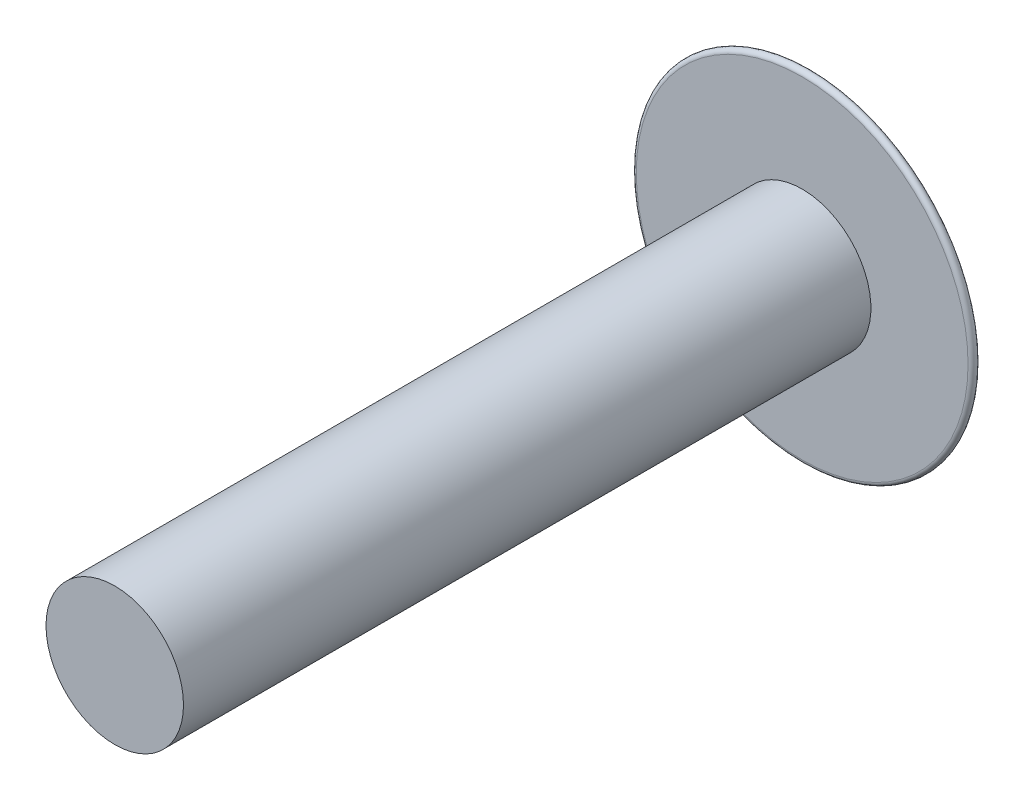
ISO-10303-21;
HEADER;
FILE_DESCRIPTION(('STEP AP214'),'2;1');
FILE_NAME('part.step','',(''),(''),'','','');
FILE_SCHEMA(('AUTOMOTIVE_DESIGN { 1 0 10303 214 1 1 1 1 }'));
ENDSEC;
DATA;
#1=APPLICATION_CONTEXT('core data for automotive mechanical design processes');
#2=APPLICATION_PROTOCOL_DEFINITION('international standard','automotive_design',2000,#1);
#3=PRODUCT_CONTEXT('',#1,'mechanical');
#4=PRODUCT('Part','Part','',(#3));
#5=PRODUCT_RELATED_PRODUCT_CATEGORY('part','',(#4));
#6=PRODUCT_DEFINITION_FORMATION('','',#4);
#7=PRODUCT_DEFINITION_CONTEXT('part definition',#1,'design');
#8=PRODUCT_DEFINITION('design','',#6,#7);
#9=PRODUCT_DEFINITION_SHAPE('','',#8);
#10=(LENGTH_UNIT() NAMED_UNIT(*) SI_UNIT(.MILLI.,.METRE.));
#11=(NAMED_UNIT(*) PLANE_ANGLE_UNIT() SI_UNIT($,.RADIAN.));
#12=(NAMED_UNIT(*) SI_UNIT($,.STERADIAN.) SOLID_ANGLE_UNIT());
#13=UNCERTAINTY_MEASURE_WITH_UNIT(LENGTH_MEASURE(1.E-05),#10,'distance_accuracy_value','');
#14=(GEOMETRIC_REPRESENTATION_CONTEXT(3) GLOBAL_UNCERTAINTY_ASSIGNED_CONTEXT((#13)) GLOBAL_UNIT_ASSIGNED_CONTEXT((#10,
#11,#12)) REPRESENTATION_CONTEXT('',''));
#15=CARTESIAN_POINT('',(0.,0.,0.));
#16=DIRECTION('',(0.,0.,1.));
#17=DIRECTION('',(1.,0.,0.));
#18=AXIS2_PLACEMENT_3D('',#15,#16,#17);
#19=CARTESIAN_POINT('',(-1.23667245925998,0.15,-0.20234762702739));
#20=DIRECTION('',(0.,1.,0.));
#21=DIRECTION('',(0.,0.,1.));
#22=AXIS2_PLACEMENT_3D('',#19,#20,#21);
#23=PLANE('',#22);
#24=CARTESIAN_POINT('',(1.9807318336479,0.15,2.25315737734632));
#25=CARTESIAN_POINT('',(2.00176052863639,0.15,2.19274277840471));
#26=CARTESIAN_POINT('',(2.01986448353778,0.15,2.13131427534168));
#27=CARTESIAN_POINT('',(2.05009869942067,0.15,2.00700083175286));
#28=CARTESIAN_POINT('',(2.0622286573749,0.15,1.94411581751581));
#29=CARTESIAN_POINT('',(2.08036874677344,0.15,1.81760477824223));
#30=CARTESIAN_POINT('',(2.08639213915598,0.15,1.75398066367697));
#31=CARTESIAN_POINT('',(2.09231778646416,0.15,1.62647545697694));
#32=CARTESIAN_POINT('',(2.09222105396279,0.15,1.56259440910054));
#33=CARTESIAN_POINT('',(2.08349415656828,0.15,1.38683733286197));
#34=CARTESIAN_POINT('',(2.0684637938988,0.15,1.27521181991642));
#35=CARTESIAN_POINT('',(2.01988606921188,0.15,1.05616586028869));
#36=CARTESIAN_POINT('',(1.98634597470009,0.15,0.948743780921732));
#37=CARTESIAN_POINT('',(1.90170344156024,0.15,0.741021943417742));
#38=CARTESIAN_POINT('',(1.85059813866008,0.15,0.640723350093115));
#39=CARTESIAN_POINT('',(1.73227201083875,0.15,0.450124398920791));
#40=CARTESIAN_POINT('',(1.66504994826993,0.15,0.359824809701372));
#41=CARTESIAN_POINT('',(1.51641828405849,0.15,0.191803912532076));
#42=CARTESIAN_POINT('',(1.43501126325792,0.15,0.114080321430438));
#43=CARTESIAN_POINT('',(1.26026013550992,0.15,-0.0266450153703614));
#44=CARTESIAN_POINT('',(1.16690966977637,0.15,-0.0896388679508981));
#45=CARTESIAN_POINT('',(0.970845529519257,0.15,-0.199158906846654));
#46=CARTESIAN_POINT('',(0.868118504639797,0.15,-0.245661137585591));
#47=CARTESIAN_POINT('',(0.656514659883268,0.15,-0.320694033740084));
#48=CARTESIAN_POINT('',(0.54765369526948,0.15,-0.34926890792244));
#49=CARTESIAN_POINT('',(0.40135063975603,0.15,-0.375001614744874));
#50=CARTESIAN_POINT('',(0.36520716651879,0.15,-0.380355348466281));
#51=CARTESIAN_POINT('',(0.29269734093965,0.15,-0.389162338362739));
#52=CARTESIAN_POINT('',(0.256331090951353,0.15,-0.392616409503886));
#53=CARTESIAN_POINT('',(0.183381573452436,0.15,-0.39772595687816));
#54=CARTESIAN_POINT('',(0.146797986027513,0.15,-0.399376627431283));
#55=CARTESIAN_POINT('',(0.0735725978190277,0.15,-0.401334388252726));
#56=CARTESIAN_POINT('',(0.0369307739791031,0.15,-0.401640337570668));
#57=CARTESIAN_POINT('',(-0.0354391833108917,0.15,-0.40164354281463));
#58=CARTESIAN_POINT('',(-0.0711673032677424,0.15,-0.401355795472978));
#59=CARTESIAN_POINT('',(-0.142589334944957,0.15,-0.399526499084391));
#60=CARTESIAN_POINT('',(-0.178283251882254,0.15,-0.397985188705217));
#61=CARTESIAN_POINT('',(-0.285129474164688,0.15,-0.390773596735302));
#62=CARTESIAN_POINT('',(-0.356135042538909,0.15,-0.382518255971762));
#63=CARTESIAN_POINT('',(-0.496622955456623,0.15,-0.358617479645475));
#64=CARTESIAN_POINT('',(-0.566109906946423,0.15,-0.342999077155867));
#65=CARTESIAN_POINT('',(-0.703109101215335,0.15,-0.304471704720529));
#66=CARTESIAN_POINT('',(-0.770619389482818,0.15,-0.281555768299838));
#67=CARTESIAN_POINT('',(-0.895778443010773,0.15,-0.231475146541525));
#68=CARTESIAN_POINT('',(-0.953712316235864,0.15,-0.205021708853274));
#69=CARTESIAN_POINT('',(-1.06675303988389,0.15,-0.14674321046169));
#70=CARTESIAN_POINT('',(-1.12186121330222,0.15,-0.114920694069969));
#71=CARTESIAN_POINT('',(-1.28252995332373,0.15,-0.0115694567467164));
#72=CARTESIAN_POINT('',(-1.38323461914015,0.15,0.0677626841474094));
#73=CARTESIAN_POINT('',(-1.55666966231021,0.15,0.233620543955632));
#74=CARTESIAN_POINT('',(-1.63129956105455,0.15,0.318188051982523));
#75=CARTESIAN_POINT('',(-1.76519705433422,0.15,0.498555460449505));
#76=CARTESIAN_POINT('',(-1.82448805619697,0.15,0.594337918361575));
#77=CARTESIAN_POINT('',(-1.92609252211714,0.15,0.794418978900494));
#78=CARTESIAN_POINT('',(-1.96841868750523,0.15,0.898711139757412));
#79=CARTESIAN_POINT('',(-2.03498688973399,0.15,1.11300069375803));
#80=CARTESIAN_POINT('',(-2.05921654008508,0.15,1.22300193961094));
#81=CARTESIAN_POINT('',(-2.08886107386277,0.15,1.44551032590493));
#82=CARTESIAN_POINT('',(-2.09427299059567,0.15,1.55801785865896));
#83=CARTESIAN_POINT('',(-2.08610082937087,0.15,1.78225445698857));
#84=CARTESIAN_POINT('',(-2.07254327539894,0.15,1.89398439044222));
#85=CARTESIAN_POINT('',(-2.04095633077018,0.15,2.04597925632334));
#86=CARTESIAN_POINT('',(-2.03078602751148,0.15,2.08799500069739));
#87=CARTESIAN_POINT('',(-2.00775991011883,0.15,2.17120562623259));
#88=CARTESIAN_POINT('',(-1.99490878711651,0.15,2.21240180540121));
#89=CARTESIAN_POINT('',(-1.98073183364791,0.15,2.25315737734632));
#90=B_SPLINE_CURVE_WITH_KNOTS('',3,(#24,#25,#26,#27,#28,#29,#30,#31,#32,#33,#34,#35,#36,#37,#38,
#39,#40,#41,#42,#43,#44,#45,#46,#47,#48,#49,#50,#51,#52,#53,#54,#55,#56,#57,#58,#59,#60,#61,#62,
#63,#64,#65,#66,#67,#68,#69,#70,#71,#72,#73,#74,#75,#76,#77,#78,#79,#80,#81,#82,#83,#84,#85,#86,
#87,#88,#89),.UNSPECIFIED.,.F.,.F.,(4,2,2,2,2,2,2,2,2,2,2,2,2,2,2,2,2,2,2,2,2,2,2,2,2,2,2,2,2,2,
2,2,4),(0.,0.191828959597776,0.383667648597912,0.575088845044785,0.766478370989555,
1.10265442548165,1.43869858044221,1.77479755848749,2.11092235471427,2.44698605940167,
2.78322943752168,3.11995925815094,3.45585540679562,3.56543777862352,3.67497310224407,
3.78479960764026,3.89471927913668,4.0018964017771,4.10905312357872,4.3231011000502,
4.53636925959417,4.74984162562359,4.94060637216062,5.1312809712609,5.51326668708469,
5.85010814570088,6.18643250737553,6.52250459533974,6.8588065036894,7.1951614290255,
7.53104651715674,7.66066260299712,7.79005374988866),.UNSPECIFIED.);
#91=CARTESIAN_POINT('',(-0.15,0.15,-0.399023887971907));
#92=VERTEX_POINT('',#91);
#93=CARTESIAN_POINT('',(-0.956971478553369,0.15,-0.20234762702739));
#94=VERTEX_POINT('',#93);
#95=EDGE_CURVE('E239',#92,#94,#90,.T.);
#96=ORIENTED_EDGE('',*,*,#95,.F.);
#97=DIRECTION('',(0.,0.,1.));
#98=VECTOR('',#97,1.);
#99=CARTESIAN_POINT('',(-0.15,0.15,-0.20234762702739));
#100=LINE('',#99,#98);
#101=CARTESIAN_POINT('',(-0.15,0.15,-0.20234762702739));
#102=VERTEX_POINT('',#101);
#103=EDGE_CURVE('E185',#92,#102,#100,.T.);
#104=ORIENTED_EDGE('',*,*,#103,.T.);
#105=DIRECTION('',(1.,0.,0.));
#106=VECTOR('',#105,1.);
#107=CARTESIAN_POINT('',(-1.23667245925998,0.15,-0.20234762702739));
#108=LINE('',#107,#106);
#109=EDGE_CURVE('E189',#94,#102,#108,.T.);
#110=ORIENTED_EDGE('',*,*,#109,.F.);
#111=EDGE_LOOP('',(#96,#104,#110));
#112=FACE_BOUND('',#111,.T.);
#113=ADVANCED_FACE('F34',(#112),#23,.F.);
#114=CARTESIAN_POINT('',(-1.23667245925998,-0.15,-0.20234762702739));
#115=DIRECTION('',(0.,-1.,0.));
#116=DIRECTION('',(0.,0.,-1.));
#117=AXIS2_PLACEMENT_3D('',#114,#115,#116);
#118=PLANE('',#117);
#119=DIRECTION('',(1.,0.,0.));
#120=VECTOR('',#119,1.);
#121=CARTESIAN_POINT('',(-1.23667245925998,-0.15,-0.20234762702739));
#122=LINE('',#121,#120);
#123=CARTESIAN_POINT('',(-0.956971478554223,-0.15,-0.20234762702739));
#124=VERTEX_POINT('',#123);
#125=CARTESIAN_POINT('',(-0.15,-0.15,-0.20234762702739));
#126=VERTEX_POINT('',#125);
#127=EDGE_CURVE('E194',#124,#126,#122,.T.);
#128=ORIENTED_EDGE('',*,*,#127,.T.);
#129=DIRECTION('',(0.,0.,-1.));
#130=VECTOR('',#129,1.);
#131=CARTESIAN_POINT('',(-0.15,-0.15,-0.20234762702739));
#132=LINE('',#131,#130);
#133=CARTESIAN_POINT('',(-0.15,-0.15,-0.399023887971445));
#134=VERTEX_POINT('',#133);
#135=EDGE_CURVE('E128',#126,#134,#132,.T.);
#136=ORIENTED_EDGE('',*,*,#135,.T.);
#137=CARTESIAN_POINT('',(-1.9807318336479,-0.15,2.25315737734632));
#138=CARTESIAN_POINT('',(-2.00176052863639,-0.15,2.19274277840471));
#139=CARTESIAN_POINT('',(-2.01986448353778,-0.15,2.13131427534168));
#140=CARTESIAN_POINT('',(-2.05009869942067,-0.15,2.00700083175286));
#141=CARTESIAN_POINT('',(-2.0622286573749,-0.15,1.94411581751581));
#142=CARTESIAN_POINT('',(-2.08036874677344,-0.15,1.81760477824222));
#143=CARTESIAN_POINT('',(-2.08639213915598,-0.15,1.75398066367697));
#144=CARTESIAN_POINT('',(-2.09231778646416,-0.15,1.62647545697694));
#145=CARTESIAN_POINT('',(-2.09222105396279,-0.15,1.56259440910054));
#146=CARTESIAN_POINT('',(-2.08349415656828,-0.15,1.38683733286197));
#147=CARTESIAN_POINT('',(-2.0684637938988,-0.15,1.27521181991642));
#148=CARTESIAN_POINT('',(-2.01988606921188,-0.15,1.05616586028869));
#149=CARTESIAN_POINT('',(-1.98634597470009,-0.15,0.948743780921732));
#150=CARTESIAN_POINT('',(-1.90170344156024,-0.15,0.741021943417742));
#151=CARTESIAN_POINT('',(-1.85059813866008,-0.15,0.640723350093114));
#152=CARTESIAN_POINT('',(-1.73227201083875,-0.15,0.450124398920791));
#153=CARTESIAN_POINT('',(-1.66504994826993,-0.15,0.359824809701372));
#154=CARTESIAN_POINT('',(-1.51641828405849,-0.15,0.191803912532076));
#155=CARTESIAN_POINT('',(-1.43501126325791,-0.15,0.114080321430438));
#156=CARTESIAN_POINT('',(-1.26026013550992,-0.15,-0.0266450153703614));
#157=CARTESIAN_POINT('',(-1.16690966977637,-0.15,-0.0896388679508985));
#158=CARTESIAN_POINT('',(-0.970845529519257,-0.15,-0.199158906846654));
#159=CARTESIAN_POINT('',(-0.868118504639797,-0.15,-0.24566113758559));
#160=CARTESIAN_POINT('',(-0.656514659883267,-0.15,-0.320694033740084));
#161=CARTESIAN_POINT('',(-0.54765369526948,-0.15,-0.34926890792244));
#162=CARTESIAN_POINT('',(-0.401350639756029,-0.15,-0.375001614744874));
#163=CARTESIAN_POINT('',(-0.36520716651879,-0.15,-0.380355348466281));
#164=CARTESIAN_POINT('',(-0.29269734093965,-0.15,-0.389162338362739));
#165=CARTESIAN_POINT('',(-0.256331090951353,-0.15,-0.392616409503886));
#166=CARTESIAN_POINT('',(-0.183381573452436,-0.15,-0.39772595687816));
#167=CARTESIAN_POINT('',(-0.146797986027513,-0.15,-0.399376627431282));
#168=CARTESIAN_POINT('',(-0.0735725978190278,-0.15,-0.401334388252726));
#169=CARTESIAN_POINT('',(-0.0369307739791032,-0.15,-0.401640337570667));
#170=CARTESIAN_POINT('',(0.0354391833108915,-0.15,-0.40164354281463));
#171=CARTESIAN_POINT('',(0.0711673032677419,-0.15,-0.401355795472978));
#172=CARTESIAN_POINT('',(0.142589334944956,-0.15,-0.399526499084391));
#173=CARTESIAN_POINT('',(0.178283251882253,-0.15,-0.397985188705217));
#174=CARTESIAN_POINT('',(0.285129474164687,-0.15,-0.390773596735302));
#175=CARTESIAN_POINT('',(0.356135042538909,-0.15,-0.382518255971762));
#176=CARTESIAN_POINT('',(0.496622955456623,-0.15,-0.358617479645475));
#177=CARTESIAN_POINT('',(0.566109906946423,-0.15,-0.342999077155867));
#178=CARTESIAN_POINT('',(0.703109101215335,-0.15,-0.304471704720529));
#179=CARTESIAN_POINT('',(0.770619389482818,-0.15,-0.281555768299838));
#180=CARTESIAN_POINT('',(0.895778443010773,-0.15,-0.231475146541525));
#181=CARTESIAN_POINT('',(0.953712316235864,-0.15,-0.205021708853274));
#182=CARTESIAN_POINT('',(1.06675303988389,-0.15,-0.14674321046169));
#183=CARTESIAN_POINT('',(1.12186121330222,-0.15,-0.11492069406997));
#184=CARTESIAN_POINT('',(1.28252995332373,-0.15,-0.0115694567467163));
#185=CARTESIAN_POINT('',(1.38323461914015,-0.15,0.0677626841474094));
#186=CARTESIAN_POINT('',(1.55666966231021,-0.15,0.233620543955631));
#187=CARTESIAN_POINT('',(1.63129956105455,-0.15,0.318188051982523));
#188=CARTESIAN_POINT('',(1.76519705433422,-0.15,0.498555460449505));
#189=CARTESIAN_POINT('',(1.82448805619697,-0.15,0.594337918361575));
#190=CARTESIAN_POINT('',(1.92609252211714,-0.15,0.794418978900494));
#191=CARTESIAN_POINT('',(1.96841868750523,-0.15,0.898711139757412));
#192=CARTESIAN_POINT('',(2.03498688973399,-0.15,1.11300069375803));
#193=CARTESIAN_POINT('',(2.05921654008508,-0.15,1.22300193961094));
#194=CARTESIAN_POINT('',(2.08886107386277,-0.15,1.44551032590493));
#195=CARTESIAN_POINT('',(2.09427299059567,-0.15,1.55801785865896));
#196=CARTESIAN_POINT('',(2.08610082937087,-0.15,1.78225445698857));
#197=CARTESIAN_POINT('',(2.07254327539894,-0.15,1.89398439044222));
#198=CARTESIAN_POINT('',(2.04095633077018,-0.15,2.04597925632334));
#199=CARTESIAN_POINT('',(2.03078602751148,-0.15,2.08799500069739));
#200=CARTESIAN_POINT('',(2.00775991011883,-0.15,2.17120562623259));
#201=CARTESIAN_POINT('',(1.99490878711651,-0.15,2.21240180540121));
#202=CARTESIAN_POINT('',(1.98073183364791,-0.15,2.25315737734632));
#203=B_SPLINE_CURVE_WITH_KNOTS('',3,(#137,#138,#139,#140,#141,#142,#143,#144,#145,#146,#147,
#148,#149,#150,#151,#152,#153,#154,#155,#156,#157,#158,#159,#160,#161,#162,#163,#164,#165,#166,
#167,#168,#169,#170,#171,#172,#173,#174,#175,#176,#177,#178,#179,#180,#181,#182,#183,#184,#185,
#186,#187,#188,#189,#190,#191,#192,#193,#194,#195,#196,#197,#198,#199,#200,#201,#202),
.UNSPECIFIED.,.F.,.F.,(4,2,2,2,2,2,2,2,2,2,2,2,2,2,2,2,2,2,2,2,2,2,2,2,2,2,2,2,2,2,2,2,4),(0.,
0.191828959597776,0.383667648597912,0.575088845044786,0.766478370989555,1.10265442548165,
1.43869858044221,1.77479755848749,2.11092235471427,2.44698605940167,2.78322943752168,
3.11995925815094,3.45585540679562,3.56543777862352,3.67497310224407,3.78479960764027,
3.89471927913668,4.0018964017771,4.10905312357872,4.3231011000502,4.53636925959417,
4.74984162562359,4.94060637216062,5.13128097126091,5.51326668708469,5.85010814570088,
6.18643250737553,6.52250459533974,6.85880650368941,7.1951614290255,7.53104651715675,
7.66066260299712,7.79005374988866),.UNSPECIFIED.);
#204=EDGE_CURVE('E209',#124,#134,#203,.T.);
#205=ORIENTED_EDGE('',*,*,#204,.F.);
#206=EDGE_LOOP('',(#128,#136,#205));
#207=FACE_BOUND('',#206,.T.);
#208=ADVANCED_FACE('F222',(#207),#118,.F.);
#209=CARTESIAN_POINT('',(0.,0.,5.));
#210=DIRECTION('',(0.,0.,-1.));
#211=DIRECTION('',(-1.,0.,0.));
#212=AXIS2_PLACEMENT_3D('',#209,#210,#211);
#213=CYLINDRICAL_SURFACE('',#212,0.5);
#214=CARTESIAN_POINT('',(0.,0.,5.));
#215=DIRECTION('',(0.,0.,1.));
#216=DIRECTION('',(1.,0.,0.));
#217=AXIS2_PLACEMENT_3D('',#214,#215,#216);
#218=CIRCLE('',#217,0.5);
#219=CARTESIAN_POINT('',(0.5,0.,5.));
#220=VERTEX_POINT('',#219);
#221=EDGE_CURVE('E199',#220,#220,#218,.T.);
#222=ORIENTED_EDGE('',*,*,#221,.F.);
#223=EDGE_LOOP('',(#222));
#224=FACE_BOUND('',#223,.T.);
#225=CARTESIAN_POINT('',(0.,0.,0.));
#226=DIRECTION('',(0.,0.,-1.));
#227=DIRECTION('',(-1.,0.,0.));
#228=AXIS2_PLACEMENT_3D('',#225,#226,#227);
#229=CIRCLE('',#228,0.5);
#230=CARTESIAN_POINT('',(-0.5,0.,0.));
#231=VERTEX_POINT('',#230);
#232=EDGE_CURVE('E192',#231,#231,#229,.T.);
#233=ORIENTED_EDGE('',*,*,#232,.F.);
#234=EDGE_LOOP('',(#233));
#235=FACE_BOUND('',#234,.T.);
#236=ADVANCED_FACE('F235',(#224,#235),#213,.T.);
#237=CARTESIAN_POINT('',(0.,0.,5.));
#238=DIRECTION('',(0.,0.,1.));
#239=DIRECTION('',(1.,0.,0.));
#240=AXIS2_PLACEMENT_3D('',#237,#238,#239);
#241=PLANE('',#240);
#242=ORIENTED_EDGE('',*,*,#221,.T.);
#243=EDGE_LOOP('',(#242));
#244=FACE_BOUND('',#243,.T.);
#245=ADVANCED_FACE('F367',(#244),#241,.T.);
#246=CARTESIAN_POINT('',(0.,0.,0.));
#247=DIRECTION('',(0.,0.,-1.));
#248=DIRECTION('',(-1.,0.,0.));
#249=AXIS2_PLACEMENT_3D('',#246,#247,#248);
#250=PLANE('',#249);
#251=CARTESIAN_POINT('',(0.,0.,0.));
#252=DIRECTION('',(0.,0.,-1.));
#253=DIRECTION('',(-1.,0.,0.));
#254=AXIS2_PLACEMENT_3D('',#251,#252,#253);
#255=CIRCLE('',#254,1.20667245925998);
#256=CARTESIAN_POINT('',(-1.20667245925998,0.,0.));
#257=VERTEX_POINT('',#256);
#258=EDGE_CURVE('E202',#257,#257,#255,.F.);
#259=ORIENTED_EDGE('',*,*,#258,.T.);
#260=EDGE_LOOP('',(#259));
#261=FACE_BOUND('',#260,.T.);
#262=ORIENTED_EDGE('',*,*,#232,.T.);
#263=EDGE_LOOP('',(#262));
#264=FACE_BOUND('',#263,.T.);
#265=ADVANCED_FACE('F352',(#261,#264),#250,.F.);
#266=CARTESIAN_POINT('',(0.,0.,1.59765237297261));
#267=DIRECTION('',(0.,0.,1.));
#268=DIRECTION('',(1.,0.,0.));
#269=AXIS2_PLACEMENT_3D('',#266,#267,#268);
#270=DEGENERATE_TOROIDAL_SURFACE('',#269,0.0968761929315048,2.,.T.);
#271=ORIENTED_EDGE('',*,*,#204,.T.);
#272=CARTESIAN_POINT('',(-0.15,1.51986574185648,0.19978563484473));
#273=CARTESIAN_POINT('',(-0.15,1.48033668470579,0.15952395746752));
#274=CARTESIAN_POINT('',(-0.15,1.43909212960415,0.120948006772945));
#275=CARTESIAN_POINT('',(-0.15,1.35349448063534,0.0474297410459339));
#276=CARTESIAN_POINT('',(-0.15,1.30914191146457,0.0124868151465816));
#277=CARTESIAN_POINT('',(-0.15,1.21811272289814,-0.0531739248528913));
#278=CARTESIAN_POINT('',(-0.15,1.17146505190894,-0.083931880331723));
#279=CARTESIAN_POINT('',(-0.15,1.07575587641082,-0.141434705018059));
#280=CARTESIAN_POINT('',(-0.15,1.02669426373527,-0.168179394176725));
#281=CARTESIAN_POINT('',(-0.15,0.926351679231923,-0.21754401180451));
#282=CARTESIAN_POINT('',(-0.15,0.875064401506339,-0.240151126037802));
#283=CARTESIAN_POINT('',(-0.15,0.770780731459415,-0.280985311831887));
#284=CARTESIAN_POINT('',(-0.15,0.717784440459191,-0.29921264251446));
#285=CARTESIAN_POINT('',(-0.15,0.610195402548457,-0.331249951732982));
#286=CARTESIAN_POINT('',(-0.15,0.55559633503521,-0.345038816396749));
#287=CARTESIAN_POINT('',(-0.15,0.47299645237588,-0.362274156216351));
#288=CARTESIAN_POINT('',(-0.15,0.445344365579856,-0.367444845307821));
#289=CARTESIAN_POINT('',(-0.15,0.389853396650167,-0.376640356102589));
#290=CARTESIAN_POINT('',(-0.15,0.362014542073925,-0.380665343205923));
#291=CARTESIAN_POINT('',(-0.15,0.296277307751538,-0.388817489766143));
#292=CARTESIAN_POINT('',(-0.15,0.258319699408649,-0.392472675081974));
#293=CARTESIAN_POINT('',(-0.15,0.182258020655554,-0.397808919462967));
#294=CARTESIAN_POINT('',(-0.15,0.144153901481863,-0.39948925145767));
#295=CARTESIAN_POINT('',(-0.15,0.0678673804423485,-0.401436821536904));
#296=CARTESIAN_POINT('',(-0.15,0.0296849430488854,-0.401702109685675));
#297=CARTESIAN_POINT('',(-0.15,-0.0466771127029377,-0.40156902130527));
#298=CARTESIAN_POINT('',(-0.15,-0.0848567310581688,-0.401170694499269));
#299=CARTESIAN_POINT('',(-0.15,-0.161132202474818,-0.398807361282795));
#300=CARTESIAN_POINT('',(-0.15,-0.199228101014246,-0.39684424732105));
#301=CARTESIAN_POINT('',(-0.15,-0.275260350536199,-0.390922096896443));
#302=CARTESIAN_POINT('',(-0.15,-0.313196731656613,-0.3869634562697));
#303=CARTESIAN_POINT('',(-0.15,-0.388716619114492,-0.376970884334261));
#304=CARTESIAN_POINT('',(-0.15,-0.426300694321727,-0.370941276238484));
#305=CARTESIAN_POINT('',(-0.15,-0.501073522510429,-0.356780177944843));
#306=CARTESIAN_POINT('',(-0.15,-0.538262229285071,-0.348648444822294));
#307=CARTESIAN_POINT('',(-0.15,-0.629807355276779,-0.325894812866979));
#308=CARTESIAN_POINT('',(-0.15,-0.683860077795966,-0.310029484936004));
#309=CARTESIAN_POINT('',(-0.15,-0.79048130356366,-0.273792564433528));
#310=CARTESIAN_POINT('',(-0.15,-0.843048464138101,-0.25341703365801));
#311=CARTESIAN_POINT('',(-0.15,-0.946181413624328,-0.208343979923589));
#312=CARTESIAN_POINT('',(-0.15,-0.996750761954164,-0.1836546119866));
#313=CARTESIAN_POINT('',(-0.15,-1.09559617956995,-0.130118919908181));
#314=CARTESIAN_POINT('',(-0.15,-1.14387357493174,-0.10127503943366));
#315=CARTESIAN_POINT('',(-0.15,-1.25027372597619,-0.0314429970767258));
#316=CARTESIAN_POINT('',(-0.15,-1.30761834529418,0.0107384607006712));
#317=CARTESIAN_POINT('',(-0.15,-1.41751214145363,0.100979977604977));
#318=CARTESIAN_POINT('',(-0.15,-1.47005961173548,0.149042114631672));
#319=CARTESIAN_POINT('',(-0.15,-1.51986574185648,0.19978563484473));
#320=B_SPLINE_CURVE_WITH_KNOTS('',3,(#272,#273,#274,#275,#276,#277,#278,#279,#280,#281,#282,
#283,#284,#285,#286,#287,#288,#289,#290,#291,#292,#293,#294,#295,#296,#297,#298,#299,#300,#301,
#302,#303,#304,#305,#306,#307,#308,#309,#310,#311,#312,#313,#314,#315,#316,#317,#318,#319),
.UNSPECIFIED.,.F.,.F.,(4,2,2,2,2,2,2,2,2,2,2,2,2,2,2,2,2,2,2,2,2,2,2,4),(0.,0.169216916307519,
0.338405333839646,0.505835176305444,0.673272528001665,0.841219974879212,1.00915748300937,
1.17788245555895,1.26225646661547,1.34661829077637,1.46095904900337,1.57534189024,
1.68988231082029,1.8044141495305,1.91880768356973,2.03317853523361,2.14731207064282,
2.26145880139321,2.43024727039228,2.59918370704388,2.76780416936099,2.93632585181641,
3.14947232404043,3.36269432886658),.UNSPECIFIED.);
#321=CARTESIAN_POINT('',(-0.15,-0.5,-0.356639498270072));
#322=VERTEX_POINT('',#321);
#323=EDGE_CURVE('E179',#134,#322,#320,.T.);
#324=ORIENTED_EDGE('',*,*,#323,.T.);
#325=CARTESIAN_POINT('',(0.510364164119245,-0.5,-0.30460267294466));
#326=CARTESIAN_POINT('',(0.449506269920126,-0.5,-0.318740711516346));
#327=CARTESIAN_POINT('',(0.388038191917324,-0.5,-0.330087719428435));
#328=CARTESIAN_POINT('',(0.264343153213808,-0.5,-0.347530677416534));
#329=CARTESIAN_POINT('',(0.202116041275197,-0.5,-0.35362556308136));
#330=CARTESIAN_POINT('',(0.0784905447349196,-0.5,-0.36082568910361));
#331=CARTESIAN_POINT('',(0.0170969263019517,-0.5,-0.362017126134148));
#332=CARTESIAN_POINT('',(-0.105588757727667,-0.5,-0.359775046659279));
#333=CARTESIAN_POINT('',(-0.16688085405579,-0.5,-0.356343374073195));
#334=CARTESIAN_POINT('',(-0.275274907445925,-0.5,-0.3458920147218));
#335=CARTESIAN_POINT('',(-0.322471678380412,-0.5,-0.339851461670415));
#336=CARTESIAN_POINT('',(-0.416690276801879,-0.5,-0.324632993616024));
#337=CARTESIAN_POINT('',(-0.463708629680572,-0.5,-0.31543364289191));
#338=CARTESIAN_POINT('',(-0.510364164119245,-0.5,-0.30460267294466));
#339=B_SPLINE_CURVE_WITH_KNOTS('',3,(#325,#326,#327,#328,#329,#330,#331,#332,#333,#334,#335,
#336,#337,#338),.UNSPECIFIED.,.F.,.F.,(4,2,2,2,2,2,4),(0.,0.187316825948604,0.374671605176916,
0.558718468801135,0.74269194737879,0.885339443097491,1.02897473386303),.UNSPECIFIED.);
#340=CARTESIAN_POINT('',(0.15,-0.5,-0.356639498270007));
#341=VERTEX_POINT('',#340);
#342=EDGE_CURVE('E11',#341,#322,#339,.T.);
#343=ORIENTED_EDGE('',*,*,#342,.F.);
#344=CARTESIAN_POINT('',(0.15,-1.51986574185648,0.19978563484473));
#345=CARTESIAN_POINT('',(0.15,-1.48033668470579,0.15952395746752));
#346=CARTESIAN_POINT('',(0.15,-1.43909212960415,0.120948006772945));
#347=CARTESIAN_POINT('',(0.15,-1.35349448063534,0.0474297410459339));
#348=CARTESIAN_POINT('',(0.15,-1.30914191146457,0.0124868151465816));
#349=CARTESIAN_POINT('',(0.15,-1.21811272289814,-0.0531739248528912));
#350=CARTESIAN_POINT('',(0.15,-1.17146505190894,-0.083931880331723));
#351=CARTESIAN_POINT('',(0.15,-1.07575587641082,-0.141434705018059));
#352=CARTESIAN_POINT('',(0.15,-1.02669426373527,-0.168179394176725));
#353=CARTESIAN_POINT('',(0.15,-0.926351679231923,-0.21754401180451));
#354=CARTESIAN_POINT('',(0.15,-0.875064401506339,-0.240151126037802));
#355=CARTESIAN_POINT('',(0.15,-0.770780731459415,-0.280985311831887));
#356=CARTESIAN_POINT('',(0.15,-0.717784440459191,-0.29921264251446));
#357=CARTESIAN_POINT('',(0.15,-0.610195402548457,-0.331249951732982));
#358=CARTESIAN_POINT('',(0.15,-0.55559633503521,-0.345038816396749));
#359=CARTESIAN_POINT('',(0.15,-0.47299645237588,-0.362274156216351));
#360=CARTESIAN_POINT('',(0.15,-0.445344365579856,-0.367444845307821));
#361=CARTESIAN_POINT('',(0.15,-0.389853396650167,-0.376640356102589));
#362=CARTESIAN_POINT('',(0.15,-0.362014542073924,-0.380665343205923));
#363=CARTESIAN_POINT('',(0.15,-0.296277307751538,-0.388817489766144));
#364=CARTESIAN_POINT('',(0.15,-0.258319699408649,-0.392472675081974));
#365=CARTESIAN_POINT('',(0.15,-0.182258020655554,-0.397808919462967));
#366=CARTESIAN_POINT('',(0.15,-0.144153901481863,-0.39948925145767));
#367=CARTESIAN_POINT('',(0.15,-0.0678673804423484,-0.401436821536904));
#368=CARTESIAN_POINT('',(0.15,-0.0296849430488853,-0.401702109685676));
#369=CARTESIAN_POINT('',(0.15,0.0466771127029378,-0.40156902130527));
#370=CARTESIAN_POINT('',(0.15,0.0848567310581689,-0.401170694499269));
#371=CARTESIAN_POINT('',(0.15,0.161132202474818,-0.398807361282795));
#372=CARTESIAN_POINT('',(0.15,0.199228101014246,-0.396844247321051));
#373=CARTESIAN_POINT('',(0.15,0.275260350536199,-0.390922096896444));
#374=CARTESIAN_POINT('',(0.15,0.313196731656613,-0.3869634562697));
#375=CARTESIAN_POINT('',(0.15,0.388716619114493,-0.376970884334261));
#376=CARTESIAN_POINT('',(0.15,0.426300694321728,-0.370941276238484));
#377=CARTESIAN_POINT('',(0.15,0.501073522510429,-0.356780177944843));
#378=CARTESIAN_POINT('',(0.15,0.538262229285071,-0.348648444822294));
#379=CARTESIAN_POINT('',(0.15,0.629807355276779,-0.325894812866979));
#380=CARTESIAN_POINT('',(0.15,0.683860077795967,-0.310029484936004));
#381=CARTESIAN_POINT('',(0.15,0.79048130356366,-0.273792564433529));
#382=CARTESIAN_POINT('',(0.15,0.843048464138102,-0.25341703365801));
#383=CARTESIAN_POINT('',(0.15,0.946181413624329,-0.208343979923589));
#384=CARTESIAN_POINT('',(0.15,0.996750761954165,-0.1836546119866));
#385=CARTESIAN_POINT('',(0.15,1.09559617956996,-0.13011891990818));
#386=CARTESIAN_POINT('',(0.15,1.14387357493174,-0.10127503943366));
#387=CARTESIAN_POINT('',(0.15,1.25027372597619,-0.0314429970767255));
#388=CARTESIAN_POINT('',(0.15,1.30761834529418,0.0107384607006714));
#389=CARTESIAN_POINT('',(0.15,1.41751214145363,0.100979977604978));
#390=CARTESIAN_POINT('',(0.15,1.47005961173549,0.149042114631672));
#391=CARTESIAN_POINT('',(0.15,1.51986574185648,0.19978563484473));
#392=B_SPLINE_CURVE_WITH_KNOTS('',3,(#344,#345,#346,#347,#348,#349,#350,#351,#352,#353,#354,
#355,#356,#357,#358,#359,#360,#361,#362,#363,#364,#365,#366,#367,#368,#369,#370,#371,#372,#373,
#374,#375,#376,#377,#378,#379,#380,#381,#382,#383,#384,#385,#386,#387,#388,#389,#390,#391),
.UNSPECIFIED.,.F.,.F.,(4,2,2,2,2,2,2,2,2,2,2,2,2,2,2,2,2,2,2,2,2,2,2,4),(0.,0.169216916307519,
0.338405333839647,0.505835176305444,0.673272528001665,0.841219974879212,1.00915748300937,
1.17788245555895,1.26225646661547,1.34661829077637,1.46095904900337,1.57534189024,
1.68988231082029,1.8044141495305,1.91880768356973,2.03317853523362,2.14731207064282,
2.26145880139321,2.43024727039228,2.59918370704388,2.76780416936099,2.93632585181641,
3.14947232404044,3.36269432886658),.UNSPECIFIED.);
#393=CARTESIAN_POINT('',(0.15,-0.15,-0.399023887971907));
#394=VERTEX_POINT('',#393);
#395=EDGE_CURVE('E146',#341,#394,#392,.T.);
#396=ORIENTED_EDGE('',*,*,#395,.T.);
#397=CARTESIAN_POINT('',(0.956971478553368,-0.15,-0.202347627027799));
#398=VERTEX_POINT('',#397);
#399=EDGE_CURVE('E208',#394,#398,#203,.T.);
#400=ORIENTED_EDGE('',*,*,#399,.T.);
#401=CARTESIAN_POINT('',(0.,0.,-0.20234762702739));
#402=DIRECTION('',(0.,0.,1.));
#403=DIRECTION('',(1.,0.,0.));
#404=AXIS2_PLACEMENT_3D('',#401,#402,#403);
#405=CIRCLE('',#404,0.96865598163964);
#406=CARTESIAN_POINT('',(0.956971478554223,0.15,-0.20234762702739));
#407=VERTEX_POINT('',#406);
#408=EDGE_CURVE('E216',#398,#407,#405,.T.);
#409=ORIENTED_EDGE('',*,*,#408,.T.);
#410=CARTESIAN_POINT('',(0.15,0.15,-0.399023887971445));
#411=VERTEX_POINT('',#410);
#412=EDGE_CURVE('E244',#407,#411,#90,.T.);
#413=ORIENTED_EDGE('',*,*,#412,.T.);
#414=CARTESIAN_POINT('',(0.15,0.5,-0.356639498270008));
#415=VERTEX_POINT('',#414);
#416=EDGE_CURVE('E156',#411,#415,#392,.T.);
#417=ORIENTED_EDGE('',*,*,#416,.T.);
#418=CARTESIAN_POINT('',(0.510364164119245,0.5,-0.30460267294466));
#419=CARTESIAN_POINT('',(0.449506269920126,0.5,-0.318740711516346));
#420=CARTESIAN_POINT('',(0.388038191917324,0.5,-0.330087719428435));
#421=CARTESIAN_POINT('',(0.264343153213808,0.5,-0.347530677416534));
#422=CARTESIAN_POINT('',(0.202116041275197,0.5,-0.35362556308136));
#423=CARTESIAN_POINT('',(0.0784905447349197,0.5,-0.36082568910361));
#424=CARTESIAN_POINT('',(0.0170969263019519,0.5,-0.362017126134148));
#425=CARTESIAN_POINT('',(-0.105588757727667,0.5,-0.359775046659279));
#426=CARTESIAN_POINT('',(-0.16688085405579,0.5,-0.356343374073195));
#427=CARTESIAN_POINT('',(-0.275274907445925,0.5,-0.3458920147218));
#428=CARTESIAN_POINT('',(-0.322471678380412,0.5,-0.339851461670415));
#429=CARTESIAN_POINT('',(-0.416690276801879,0.5,-0.324632993616024));
#430=CARTESIAN_POINT('',(-0.463708629680572,0.5,-0.31543364289191));
#431=CARTESIAN_POINT('',(-0.510364164119245,0.5,-0.30460267294466));
#432=B_SPLINE_CURVE_WITH_KNOTS('',3,(#418,#419,#420,#421,#422,#423,#424,#425,#426,#427,#428,
#429,#430,#431),.UNSPECIFIED.,.F.,.F.,(4,2,2,2,2,2,4),(0.,0.187316825948604,0.374671605176916,
0.558718468801135,0.74269194737879,0.885339443097491,1.02897473386303),.UNSPECIFIED.);
#433=CARTESIAN_POINT('',(-0.15,0.5,-0.356639498270072));
#434=VERTEX_POINT('',#433);
#435=EDGE_CURVE('E48',#415,#434,#432,.T.);
#436=ORIENTED_EDGE('',*,*,#435,.T.);
#437=EDGE_CURVE('E186',#434,#92,#320,.T.);
#438=ORIENTED_EDGE('',*,*,#437,.T.);
#439=ORIENTED_EDGE('',*,*,#95,.T.);
#440=EDGE_CURVE('E245',#94,#124,#405,.T.);
#441=ORIENTED_EDGE('',*,*,#440,.T.);
#442=EDGE_LOOP('',(#271,#324,#343,#396,#400,#409,#413,#417,#436,#438,#439,#441));
#443=FACE_BOUND('',#442,.T.);
#444=CARTESIAN_POINT('',(0.,0.,-0.0547865843599888));
#445=DIRECTION('',(0.,0.,1.));
#446=DIRECTION('',(1.,0.,0.));
#447=AXIS2_PLACEMENT_3D('',#444,#445,#446);
#448=CIRCLE('',#447,1.22357291001625);
#449=CARTESIAN_POINT('',(1.22357291001625,0.,-0.0547865843599888));
#450=VERTEX_POINT('',#449);
#451=EDGE_CURVE('E205',#450,#450,#448,.F.);
#452=ORIENTED_EDGE('',*,*,#451,.T.);
#453=EDGE_LOOP('',(#452));
#454=FACE_BOUND('',#453,.T.);
#455=ADVANCED_FACE('F158',(#443,#454),#270,.T.);
#456=CARTESIAN_POINT('',(0.,0.,-0.0299999999999999));
#457=DIRECTION('',(0.,0.,-1.));
#458=DIRECTION('',(-1.,0.,0.));
#459=AXIS2_PLACEMENT_3D('',#456,#457,#458);
#460=TOROIDAL_SURFACE('',#459,1.20667245925998,0.03);
#461=ORIENTED_EDGE('',*,*,#451,.F.);
#462=EDGE_LOOP('',(#461));
#463=FACE_BOUND('',#462,.T.);
#464=ORIENTED_EDGE('',*,*,#258,.F.);
#465=EDGE_LOOP('',(#464));
#466=FACE_BOUND('',#465,.T.);
#467=ADVANCED_FACE('F36',(#463,#466),#460,.T.);
#468=CARTESIAN_POINT('',(-1.23667245925998,0.15,-0.20234762702739));
#469=DIRECTION('',(0.,0.,1.));
#470=DIRECTION('',(1.,0.,0.));
#471=AXIS2_PLACEMENT_3D('',#468,#469,#470);
#472=PLANE('',#471);
#473=CARTESIAN_POINT('',(0.15,-0.15,-0.20234762702739));
#474=VERTEX_POINT('',#473);
#475=EDGE_CURVE('E196',#474,#398,#122,.T.);
#476=ORIENTED_EDGE('',*,*,#475,.F.);
#477=DIRECTION('',(0.,1.,0.));
#478=VECTOR('',#477,1.);
#479=CARTESIAN_POINT('',(0.15,-0.5,-0.20234762702739));
#480=LINE('',#479,#478);
#481=CARTESIAN_POINT('',(0.15,-0.5,-0.20234762702739));
#482=VERTEX_POINT('',#481);
#483=EDGE_CURVE('E134',#482,#474,#480,.T.);
#484=ORIENTED_EDGE('',*,*,#483,.F.);
#485=DIRECTION('',(1.,0.,0.));
#486=VECTOR('',#485,1.);
#487=CARTESIAN_POINT('',(-0.15,-0.5,-0.20234762702739));
#488=LINE('',#487,#486);
#489=CARTESIAN_POINT('',(-0.15,-0.5,-0.20234762702739));
#490=VERTEX_POINT('',#489);
#491=EDGE_CURVE('E120',#490,#482,#488,.T.);
#492=ORIENTED_EDGE('',*,*,#491,.F.);
#493=DIRECTION('',(0.,1.,0.));
#494=VECTOR('',#493,1.);
#495=CARTESIAN_POINT('',(-0.15,-0.5,-0.20234762702739));
#496=LINE('',#495,#494);
#497=EDGE_CURVE('E62',#490,#126,#496,.T.);
#498=ORIENTED_EDGE('',*,*,#497,.T.);
#499=ORIENTED_EDGE('',*,*,#127,.F.);
#500=ORIENTED_EDGE('',*,*,#440,.F.);
#501=ORIENTED_EDGE('',*,*,#109,.T.);
#502=CARTESIAN_POINT('',(-0.15,0.5,-0.20234762702739));
#503=VERTEX_POINT('',#502);
#504=EDGE_CURVE('E130',#102,#503,#496,.T.);
#505=ORIENTED_EDGE('',*,*,#504,.T.);
#506=DIRECTION('',(1.,0.,0.));
#507=VECTOR('',#506,1.);
#508=CARTESIAN_POINT('',(-0.15,0.5,-0.20234762702739));
#509=LINE('',#508,#507);
#510=CARTESIAN_POINT('',(0.15,0.5,-0.20234762702739));
#511=VERTEX_POINT('',#510);
#512=EDGE_CURVE('E142',#503,#511,#509,.T.);
#513=ORIENTED_EDGE('',*,*,#512,.T.);
#514=CARTESIAN_POINT('',(0.15,0.15,-0.20234762702739));
#515=VERTEX_POINT('',#514);
#516=EDGE_CURVE('E55',#515,#511,#480,.T.);
#517=ORIENTED_EDGE('',*,*,#516,.F.);
#518=EDGE_CURVE('E193',#515,#407,#108,.T.);
#519=ORIENTED_EDGE('',*,*,#518,.T.);
#520=ORIENTED_EDGE('',*,*,#408,.F.);
#521=EDGE_LOOP('',(#476,#484,#492,#498,#499,#500,#501,#505,#513,#517,#519,#520));
#522=FACE_BOUND('',#521,.T.);
#523=ADVANCED_FACE('F133',(#522),#472,.F.);
#524=ORIENTED_EDGE('',*,*,#518,.F.);
#525=DIRECTION('',(0.,0.,-1.));
#526=VECTOR('',#525,1.);
#527=CARTESIAN_POINT('',(0.15,0.15,-0.20234762702739));
#528=LINE('',#527,#526);
#529=EDGE_CURVE('E155',#515,#411,#528,.T.);
#530=ORIENTED_EDGE('',*,*,#529,.T.);
#531=ORIENTED_EDGE('',*,*,#412,.F.);
#532=EDGE_LOOP('',(#524,#530,#531));
#533=FACE_BOUND('',#532,.T.);
#534=ADVANCED_FACE('F176',(#533),#23,.F.);
#535=ORIENTED_EDGE('',*,*,#399,.F.);
#536=DIRECTION('',(0.,0.,1.));
#537=VECTOR('',#536,1.);
#538=CARTESIAN_POINT('',(0.15,-0.15,-0.20234762702739));
#539=LINE('',#538,#537);
#540=EDGE_CURVE('E247',#394,#474,#539,.T.);
#541=ORIENTED_EDGE('',*,*,#540,.T.);
#542=ORIENTED_EDGE('',*,*,#475,.T.);
#543=EDGE_LOOP('',(#535,#541,#542));
#544=FACE_BOUND('',#543,.T.);
#545=ADVANCED_FACE('F218',(#544),#118,.F.);
#546=CARTESIAN_POINT('',(0.15,-0.5,-0.401641944848349));
#547=DIRECTION('',(1.,0.,0.));
#548=DIRECTION('',(0.,0.,-1.));
#549=AXIS2_PLACEMENT_3D('',#546,#547,#548);
#550=PLANE('',#549);
#551=DIRECTION('',(0.,0.,-1.));
#552=VECTOR('',#551,1.);
#553=CARTESIAN_POINT('',(0.15,-0.5,-0.401641944848349));
#554=LINE('',#553,#552);
#555=EDGE_CURVE('E136',#482,#341,#554,.T.);
#556=ORIENTED_EDGE('',*,*,#555,.F.);
#557=ORIENTED_EDGE('',*,*,#483,.T.);
#558=ORIENTED_EDGE('',*,*,#540,.F.);
#559=ORIENTED_EDGE('',*,*,#395,.F.);
#560=EDGE_LOOP('',(#556,#557,#558,#559));
#561=FACE_BOUND('',#560,.T.);
#562=ADVANCED_FACE('F169',(#561),#550,.F.);
#563=CARTESIAN_POINT('',(-0.15,-0.5,-0.401641944848349));
#564=DIRECTION('',(-1.,0.,0.));
#565=DIRECTION('',(0.,0.,1.));
#566=AXIS2_PLACEMENT_3D('',#563,#564,#565);
#567=PLANE('',#566);
#568=ORIENTED_EDGE('',*,*,#135,.F.);
#569=ORIENTED_EDGE('',*,*,#497,.F.);
#570=DIRECTION('',(0.,0.,1.));
#571=VECTOR('',#570,1.);
#572=CARTESIAN_POINT('',(-0.15,-0.5,-0.401641944848349));
#573=LINE('',#572,#571);
#574=EDGE_CURVE('E117',#322,#490,#573,.T.);
#575=ORIENTED_EDGE('',*,*,#574,.F.);
#576=ORIENTED_EDGE('',*,*,#323,.F.);
#577=EDGE_LOOP('',(#568,#569,#575,#576));
#578=FACE_BOUND('',#577,.T.);
#579=ADVANCED_FACE('F126',(#578),#567,.F.);
#580=CARTESIAN_POINT('',(0.,-0.5,0.));
#581=DIRECTION('',(0.,1.,0.));
#582=DIRECTION('',(0.,0.,1.));
#583=AXIS2_PLACEMENT_3D('',#580,#581,#582);
#584=PLANE('',#583);
#585=ORIENTED_EDGE('',*,*,#342,.T.);
#586=ORIENTED_EDGE('',*,*,#574,.T.);
#587=ORIENTED_EDGE('',*,*,#491,.T.);
#588=ORIENTED_EDGE('',*,*,#555,.T.);
#589=EDGE_LOOP('',(#585,#586,#587,#588));
#590=FACE_BOUND('',#589,.T.);
#591=ADVANCED_FACE('F118',(#590),#584,.T.);
#592=CARTESIAN_POINT('',(0.,0.5,0.));
#593=DIRECTION('',(0.,1.,0.));
#594=DIRECTION('',(0.,0.,1.));
#595=AXIS2_PLACEMENT_3D('',#592,#593,#594);
#596=PLANE('',#595);
#597=DIRECTION('',(0.,0.,-1.));
#598=VECTOR('',#597,1.);
#599=CARTESIAN_POINT('',(0.15,0.5,-0.401641944848349));
#600=LINE('',#599,#598);
#601=EDGE_CURVE('E124',#511,#415,#600,.T.);
#602=ORIENTED_EDGE('',*,*,#601,.F.);
#603=ORIENTED_EDGE('',*,*,#512,.F.);
#604=DIRECTION('',(0.,0.,1.));
#605=VECTOR('',#604,1.);
#606=CARTESIAN_POINT('',(-0.15,0.5,-0.401641944848349));
#607=LINE('',#606,#605);
#608=EDGE_CURVE('E140',#434,#503,#607,.T.);
#609=ORIENTED_EDGE('',*,*,#608,.F.);
#610=ORIENTED_EDGE('',*,*,#435,.F.);
#611=EDGE_LOOP('',(#602,#603,#609,#610));
#612=FACE_BOUND('',#611,.T.);
#613=ADVANCED_FACE('F170',(#612),#596,.F.);
#614=ORIENTED_EDGE('',*,*,#608,.T.);
#615=ORIENTED_EDGE('',*,*,#504,.F.);
#616=ORIENTED_EDGE('',*,*,#103,.F.);
#617=ORIENTED_EDGE('',*,*,#437,.F.);
#618=EDGE_LOOP('',(#614,#615,#616,#617));
#619=FACE_BOUND('',#618,.T.);
#620=ADVANCED_FACE('F167',(#619),#567,.F.);
#621=ORIENTED_EDGE('',*,*,#529,.F.);
#622=ORIENTED_EDGE('',*,*,#516,.T.);
#623=ORIENTED_EDGE('',*,*,#601,.T.);
#624=ORIENTED_EDGE('',*,*,#416,.F.);
#625=EDGE_LOOP('',(#621,#622,#623,#624));
#626=FACE_BOUND('',#625,.T.);
#627=ADVANCED_FACE('F162',(#626),#550,.F.);
#628=CLOSED_SHELL('',(#113,#208,#236,#245,#265,#455,#467,#523,#534,#545,#562,#579,#591,#613,
#620,#627));
#629=MANIFOLD_SOLID_BREP('B2',#628);
#630=ADVANCED_BREP_SHAPE_REPRESENTATION('',(#18,#629),#14);
#631=SHAPE_DEFINITION_REPRESENTATION(#9,#630);
ENDSEC;
END-ISO-10303-21;
